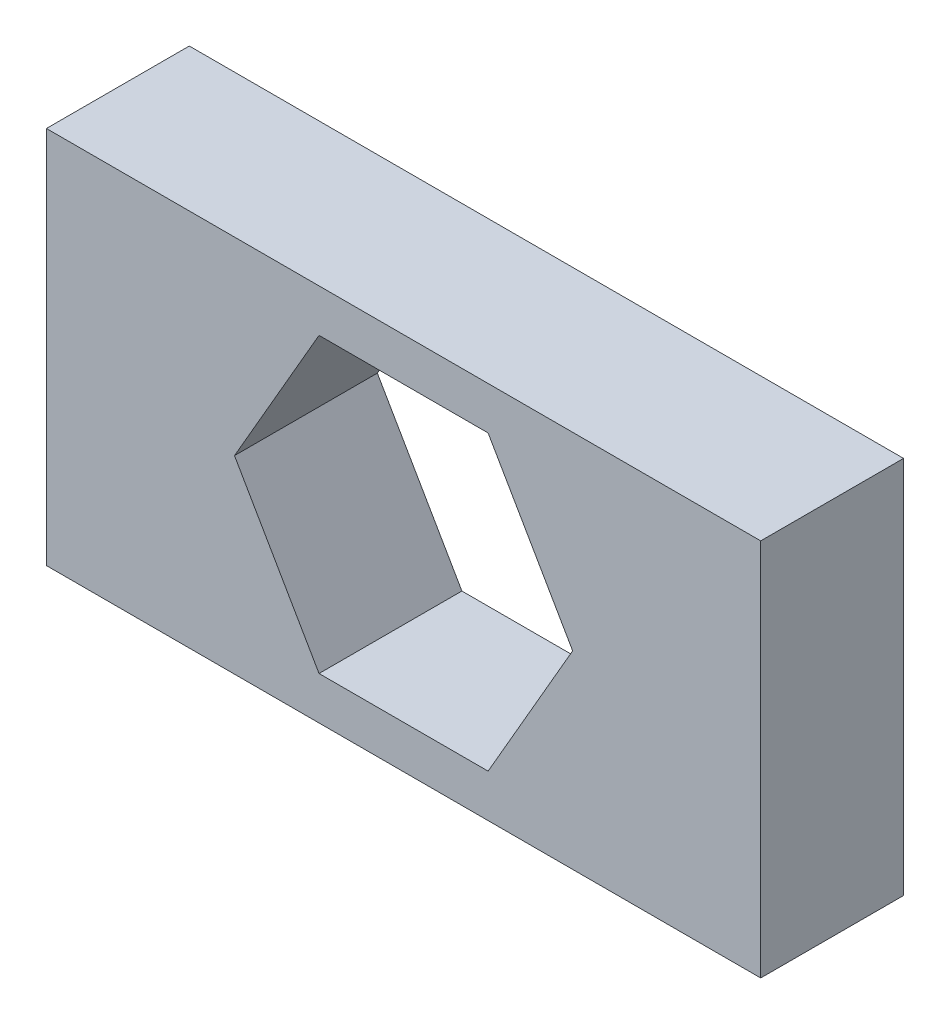
ISO-10303-21;
HEADER;
FILE_DESCRIPTION(('STEP AP214'),'2;1');
FILE_NAME('part.step','',(''),(''),'','','');
FILE_SCHEMA(('AUTOMOTIVE_DESIGN { 1 0 10303 214 1 1 1 1 }'));
ENDSEC;
DATA;
#1=APPLICATION_CONTEXT('core data for automotive mechanical design processes');
#2=APPLICATION_PROTOCOL_DEFINITION('international standard','automotive_design',2000,#1);
#3=PRODUCT_CONTEXT('',#1,'mechanical');
#4=PRODUCT('Part','Part','',(#3));
#5=PRODUCT_RELATED_PRODUCT_CATEGORY('part','',(#4));
#6=PRODUCT_DEFINITION_FORMATION('','',#4);
#7=PRODUCT_DEFINITION_CONTEXT('part definition',#1,'design');
#8=PRODUCT_DEFINITION('design','',#6,#7);
#9=PRODUCT_DEFINITION_SHAPE('','',#8);
#10=(LENGTH_UNIT() NAMED_UNIT(*) SI_UNIT(.MILLI.,.METRE.));
#11=(NAMED_UNIT(*) PLANE_ANGLE_UNIT() SI_UNIT($,.RADIAN.));
#12=(NAMED_UNIT(*) SI_UNIT($,.STERADIAN.) SOLID_ANGLE_UNIT());
#13=UNCERTAINTY_MEASURE_WITH_UNIT(LENGTH_MEASURE(1.E-05),#10,'distance_accuracy_value','');
#14=(GEOMETRIC_REPRESENTATION_CONTEXT(3) GLOBAL_UNCERTAINTY_ASSIGNED_CONTEXT((#13)) GLOBAL_UNIT_ASSIGNED_CONTEXT((#10,
#11,#12)) REPRESENTATION_CONTEXT('',''));
#15=CARTESIAN_POINT('',(0.,0.,0.));
#16=DIRECTION('',(0.,0.,1.));
#17=DIRECTION('',(1.,0.,0.));
#18=AXIS2_PLACEMENT_3D('',#15,#16,#17);
#19=CARTESIAN_POINT('',(0.,0.,2.));
#20=DIRECTION('',(0.,0.,1.));
#21=DIRECTION('',(1.,0.,0.));
#22=AXIS2_PLACEMENT_3D('',#19,#20,#21);
#23=PLANE('',#22);
#24=DIRECTION('',(0.,1.,0.));
#25=VECTOR('',#24,1.);
#26=CARTESIAN_POINT('',(5.,2.65,2.));
#27=LINE('',#26,#25);
#28=CARTESIAN_POINT('',(5.,-2.65,2.));
#29=VERTEX_POINT('',#28);
#30=CARTESIAN_POINT('',(5.,2.65,2.));
#31=VERTEX_POINT('',#30);
#32=EDGE_CURVE('E161',#29,#31,#27,.T.);
#33=ORIENTED_EDGE('',*,*,#32,.T.);
#34=DIRECTION('',(-1.,0.,0.));
#35=VECTOR('',#34,1.);
#36=CARTESIAN_POINT('',(-5.,2.65,2.));
#37=LINE('',#36,#35);
#38=CARTESIAN_POINT('',(-5.,2.65,2.));
#39=VERTEX_POINT('',#38);
#40=EDGE_CURVE('E164',#31,#39,#37,.T.);
#41=ORIENTED_EDGE('',*,*,#40,.T.);
#42=DIRECTION('',(0.,-1.,0.));
#43=VECTOR('',#42,1.);
#44=CARTESIAN_POINT('',(-5.,2.65,2.));
#45=LINE('',#44,#43);
#46=CARTESIAN_POINT('',(-5.,-2.65,2.));
#47=VERTEX_POINT('',#46);
#48=EDGE_CURVE('E167',#39,#47,#45,.T.);
#49=ORIENTED_EDGE('',*,*,#48,.T.);
#50=DIRECTION('',(1.,0.,0.));
#51=VECTOR('',#50,1.);
#52=CARTESIAN_POINT('',(-5.,-2.65,2.));
#53=LINE('',#52,#51);
#54=EDGE_CURVE('E169',#47,#29,#53,.T.);
#55=ORIENTED_EDGE('',*,*,#54,.T.);
#56=EDGE_LOOP('',(#33,#41,#49,#55));
#57=FACE_BOUND('',#56,.T.);
#58=DIRECTION('',(-0.5,0.866025403784438,0.));
#59=VECTOR('',#58,1.);
#60=CARTESIAN_POINT('',(2.36713610367747,0.,2.));
#61=LINE('',#60,#59);
#62=CARTESIAN_POINT('',(2.36713610367747,0.,2.));
#63=VERTEX_POINT('',#62);
#64=CARTESIAN_POINT('',(1.18356805183873,2.05,2.));
#65=VERTEX_POINT('',#64);
#66=EDGE_CURVE('E118',#63,#65,#61,.T.);
#67=ORIENTED_EDGE('',*,*,#66,.F.);
#68=DIRECTION('',(0.5,0.866025403784439,0.));
#69=VECTOR('',#68,1.);
#70=CARTESIAN_POINT('',(1.18356805183873,-2.05,2.));
#71=LINE('',#70,#69);
#72=CARTESIAN_POINT('',(1.18356805183873,-2.05,2.));
#73=VERTEX_POINT('',#72);
#74=EDGE_CURVE('E110',#73,#63,#71,.T.);
#75=ORIENTED_EDGE('',*,*,#74,.F.);
#76=DIRECTION('',(1.,0.,0.));
#77=VECTOR('',#76,1.);
#78=CARTESIAN_POINT('',(-1.18356805183873,-2.05,2.));
#79=LINE('',#78,#77);
#80=CARTESIAN_POINT('',(-1.18356805183873,-2.05,2.));
#81=VERTEX_POINT('',#80);
#82=EDGE_CURVE('E139',#81,#73,#79,.T.);
#83=ORIENTED_EDGE('',*,*,#82,.F.);
#84=DIRECTION('',(0.5,-0.866025403784438,0.));
#85=VECTOR('',#84,1.);
#86=CARTESIAN_POINT('',(-2.36713610367746,0.,2.));
#87=LINE('',#86,#85);
#88=CARTESIAN_POINT('',(-2.36713610367746,0.,2.));
#89=VERTEX_POINT('',#88);
#90=EDGE_CURVE('E137',#89,#81,#87,.T.);
#91=ORIENTED_EDGE('',*,*,#90,.F.);
#92=DIRECTION('',(-0.5,-0.866025403784439,0.));
#93=VECTOR('',#92,1.);
#94=CARTESIAN_POINT('',(-1.18356805183873,2.05,2.));
#95=LINE('',#94,#93);
#96=CARTESIAN_POINT('',(-1.18356805183873,2.05,2.));
#97=VERTEX_POINT('',#96);
#98=EDGE_CURVE('E133',#97,#89,#95,.T.);
#99=ORIENTED_EDGE('',*,*,#98,.F.);
#100=DIRECTION('',(-1.,0.,0.));
#101=VECTOR('',#100,1.);
#102=CARTESIAN_POINT('',(1.18356805183873,2.05,2.));
#103=LINE('',#102,#101);
#104=EDGE_CURVE('E131',#65,#97,#103,.T.);
#105=ORIENTED_EDGE('',*,*,#104,.F.);
#106=EDGE_LOOP('',(#67,#75,#83,#91,#99,#105));
#107=FACE_BOUND('',#106,.T.);
#108=ADVANCED_FACE('F33',(#57,#107),#23,.T.);
#109=CARTESIAN_POINT('',(0.,0.,0.));
#110=DIRECTION('',(0.,0.,1.));
#111=DIRECTION('',(1.,0.,0.));
#112=AXIS2_PLACEMENT_3D('',#109,#110,#111);
#113=PLANE('',#112);
#114=DIRECTION('',(0.,1.,0.));
#115=VECTOR('',#114,1.);
#116=CARTESIAN_POINT('',(5.,2.65,0.));
#117=LINE('',#116,#115);
#118=CARTESIAN_POINT('',(5.,-2.65,0.));
#119=VERTEX_POINT('',#118);
#120=CARTESIAN_POINT('',(5.,2.65,0.));
#121=VERTEX_POINT('',#120);
#122=EDGE_CURVE('E126',#119,#121,#117,.T.);
#123=ORIENTED_EDGE('',*,*,#122,.F.);
#124=DIRECTION('',(1.,0.,0.));
#125=VECTOR('',#124,1.);
#126=CARTESIAN_POINT('',(-5.,-2.65,0.));
#127=LINE('',#126,#125);
#128=CARTESIAN_POINT('',(-5.,-2.65,0.));
#129=VERTEX_POINT('',#128);
#130=EDGE_CURVE('E165',#129,#119,#127,.T.);
#131=ORIENTED_EDGE('',*,*,#130,.F.);
#132=DIRECTION('',(0.,-1.,0.));
#133=VECTOR('',#132,1.);
#134=CARTESIAN_POINT('',(-5.,2.65,0.));
#135=LINE('',#134,#133);
#136=CARTESIAN_POINT('',(-5.,2.65,0.));
#137=VERTEX_POINT('',#136);
#138=EDGE_CURVE('E176',#137,#129,#135,.T.);
#139=ORIENTED_EDGE('',*,*,#138,.F.);
#140=DIRECTION('',(-1.,0.,0.));
#141=VECTOR('',#140,1.);
#142=CARTESIAN_POINT('',(-5.,2.65,0.));
#143=LINE('',#142,#141);
#144=EDGE_CURVE('E174',#121,#137,#143,.T.);
#145=ORIENTED_EDGE('',*,*,#144,.F.);
#146=EDGE_LOOP('',(#123,#131,#139,#145));
#147=FACE_BOUND('',#146,.T.);
#148=DIRECTION('',(0.5,0.866025403784439,0.));
#149=VECTOR('',#148,1.);
#150=CARTESIAN_POINT('',(1.18356805183873,-2.05,0.));
#151=LINE('',#150,#149);
#152=CARTESIAN_POINT('',(1.18356805183873,-2.05,0.));
#153=VERTEX_POINT('',#152);
#154=CARTESIAN_POINT('',(2.36713610367747,0.,0.));
#155=VERTEX_POINT('',#154);
#156=EDGE_CURVE('E56',#153,#155,#151,.T.);
#157=ORIENTED_EDGE('',*,*,#156,.T.);
#158=DIRECTION('',(-0.5,0.866025403784438,0.));
#159=VECTOR('',#158,1.);
#160=CARTESIAN_POINT('',(2.36713610367747,0.,0.));
#161=LINE('',#160,#159);
#162=CARTESIAN_POINT('',(1.18356805183873,2.05,0.));
#163=VERTEX_POINT('',#162);
#164=EDGE_CURVE('E125',#155,#163,#161,.T.);
#165=ORIENTED_EDGE('',*,*,#164,.T.);
#166=DIRECTION('',(-1.,0.,0.));
#167=VECTOR('',#166,1.);
#168=CARTESIAN_POINT('',(1.18356805183873,2.05,0.));
#169=LINE('',#168,#167);
#170=CARTESIAN_POINT('',(-1.18356805183873,2.05,0.));
#171=VERTEX_POINT('',#170);
#172=EDGE_CURVE('E143',#163,#171,#169,.T.);
#173=ORIENTED_EDGE('',*,*,#172,.T.);
#174=DIRECTION('',(-0.5,-0.866025403784439,0.));
#175=VECTOR('',#174,1.);
#176=CARTESIAN_POINT('',(-1.18356805183873,2.05,0.));
#177=LINE('',#176,#175);
#178=CARTESIAN_POINT('',(-2.36713610367746,0.,0.));
#179=VERTEX_POINT('',#178);
#180=EDGE_CURVE('E146',#171,#179,#177,.T.);
#181=ORIENTED_EDGE('',*,*,#180,.T.);
#182=DIRECTION('',(0.5,-0.866025403784438,0.));
#183=VECTOR('',#182,1.);
#184=CARTESIAN_POINT('',(-2.36713610367746,0.,0.));
#185=LINE('',#184,#183);
#186=CARTESIAN_POINT('',(-1.18356805183873,-2.05,0.));
#187=VERTEX_POINT('',#186);
#188=EDGE_CURVE('E149',#179,#187,#185,.T.);
#189=ORIENTED_EDGE('',*,*,#188,.T.);
#190=DIRECTION('',(1.,0.,0.));
#191=VECTOR('',#190,1.);
#192=CARTESIAN_POINT('',(-1.18356805183873,-2.05,0.));
#193=LINE('',#192,#191);
#194=EDGE_CURVE('E119',#187,#153,#193,.T.);
#195=ORIENTED_EDGE('',*,*,#194,.T.);
#196=EDGE_LOOP('',(#157,#165,#173,#181,#189,#195));
#197=FACE_BOUND('',#196,.T.);
#198=ADVANCED_FACE('F194',(#147,#197),#113,.F.);
#199=CARTESIAN_POINT('',(5.,2.65,2.));
#200=DIRECTION('',(-1.,0.,0.));
#201=DIRECTION('',(0.,-1.,0.));
#202=AXIS2_PLACEMENT_3D('',#199,#200,#201);
#203=PLANE('',#202);
#204=ORIENTED_EDGE('',*,*,#122,.T.);
#205=DIRECTION('',(0.,0.,-1.));
#206=VECTOR('',#205,1.);
#207=CARTESIAN_POINT('',(5.,2.65,2.));
#208=LINE('',#207,#206);
#209=EDGE_CURVE('E11',#31,#121,#208,.T.);
#210=ORIENTED_EDGE('',*,*,#209,.F.);
#211=ORIENTED_EDGE('',*,*,#32,.F.);
#212=DIRECTION('',(0.,0.,-1.));
#213=VECTOR('',#212,1.);
#214=CARTESIAN_POINT('',(5.,-2.65,2.));
#215=LINE('',#214,#213);
#216=EDGE_CURVE('E171',#29,#119,#215,.T.);
#217=ORIENTED_EDGE('',*,*,#216,.T.);
#218=EDGE_LOOP('',(#204,#210,#211,#217));
#219=FACE_BOUND('',#218,.T.);
#220=ADVANCED_FACE('F35',(#219),#203,.F.);
#221=CARTESIAN_POINT('',(-5.,2.65,2.));
#222=DIRECTION('',(0.,-1.,0.));
#223=DIRECTION('',(0.,0.,-1.));
#224=AXIS2_PLACEMENT_3D('',#221,#222,#223);
#225=PLANE('',#224);
#226=ORIENTED_EDGE('',*,*,#144,.T.);
#227=DIRECTION('',(0.,0.,-1.));
#228=VECTOR('',#227,1.);
#229=CARTESIAN_POINT('',(-5.,2.65,2.));
#230=LINE('',#229,#228);
#231=EDGE_CURVE('E41',#39,#137,#230,.T.);
#232=ORIENTED_EDGE('',*,*,#231,.F.);
#233=ORIENTED_EDGE('',*,*,#40,.F.);
#234=ORIENTED_EDGE('',*,*,#209,.T.);
#235=EDGE_LOOP('',(#226,#232,#233,#234));
#236=FACE_BOUND('',#235,.T.);
#237=ADVANCED_FACE('F204',(#236),#225,.F.);
#238=CARTESIAN_POINT('',(-5.,2.65,2.));
#239=DIRECTION('',(1.,0.,0.));
#240=DIRECTION('',(0.,0.,-1.));
#241=AXIS2_PLACEMENT_3D('',#238,#239,#240);
#242=PLANE('',#241);
#243=ORIENTED_EDGE('',*,*,#138,.T.);
#244=DIRECTION('',(0.,0.,-1.));
#245=VECTOR('',#244,1.);
#246=CARTESIAN_POINT('',(-5.,-2.65,2.));
#247=LINE('',#246,#245);
#248=EDGE_CURVE('E181',#47,#129,#247,.T.);
#249=ORIENTED_EDGE('',*,*,#248,.F.);
#250=ORIENTED_EDGE('',*,*,#48,.F.);
#251=ORIENTED_EDGE('',*,*,#231,.T.);
#252=EDGE_LOOP('',(#243,#249,#250,#251));
#253=FACE_BOUND('',#252,.T.);
#254=ADVANCED_FACE('F188',(#253),#242,.F.);
#255=CARTESIAN_POINT('',(-5.,-2.65,2.));
#256=DIRECTION('',(0.,1.,0.));
#257=DIRECTION('',(-1.,0.,0.));
#258=AXIS2_PLACEMENT_3D('',#255,#256,#257);
#259=PLANE('',#258);
#260=ORIENTED_EDGE('',*,*,#130,.T.);
#261=ORIENTED_EDGE('',*,*,#216,.F.);
#262=ORIENTED_EDGE('',*,*,#54,.F.);
#263=ORIENTED_EDGE('',*,*,#248,.T.);
#264=EDGE_LOOP('',(#260,#261,#262,#263));
#265=FACE_BOUND('',#264,.T.);
#266=ADVANCED_FACE('F198',(#265),#259,.F.);
#267=CARTESIAN_POINT('',(1.18356805183873,-2.05,2.));
#268=DIRECTION('',(-0.866025403784439,0.5,0.));
#269=DIRECTION('',(-0.5,-0.866025403784439,0.));
#270=AXIS2_PLACEMENT_3D('',#267,#268,#269);
#271=PLANE('',#270);
#272=ORIENTED_EDGE('',*,*,#156,.F.);
#273=DIRECTION('',(0.,0.,-1.));
#274=VECTOR('',#273,1.);
#275=CARTESIAN_POINT('',(1.18356805183873,-2.05,2.));
#276=LINE('',#275,#274);
#277=EDGE_CURVE('E114',#73,#153,#276,.T.);
#278=ORIENTED_EDGE('',*,*,#277,.F.);
#279=ORIENTED_EDGE('',*,*,#74,.T.);
#280=DIRECTION('',(0.,0.,-1.));
#281=VECTOR('',#280,1.);
#282=CARTESIAN_POINT('',(2.36713610367747,0.,2.));
#283=LINE('',#282,#281);
#284=EDGE_CURVE('E113',#63,#155,#283,.T.);
#285=ORIENTED_EDGE('',*,*,#284,.T.);
#286=EDGE_LOOP('',(#272,#278,#279,#285));
#287=FACE_BOUND('',#286,.T.);
#288=ADVANCED_FACE('F112',(#287),#271,.T.);
#289=CARTESIAN_POINT('',(2.36713610367747,0.,2.));
#290=DIRECTION('',(-0.866025403784439,-0.5,0.));
#291=DIRECTION('',(0.5,-0.866025403784438,0.));
#292=AXIS2_PLACEMENT_3D('',#289,#290,#291);
#293=PLANE('',#292);
#294=ORIENTED_EDGE('',*,*,#164,.F.);
#295=ORIENTED_EDGE('',*,*,#284,.F.);
#296=ORIENTED_EDGE('',*,*,#66,.T.);
#297=DIRECTION('',(0.,0.,-1.));
#298=VECTOR('',#297,1.);
#299=CARTESIAN_POINT('',(1.18356805183873,2.05,2.));
#300=LINE('',#299,#298);
#301=EDGE_CURVE('E127',#65,#163,#300,.T.);
#302=ORIENTED_EDGE('',*,*,#301,.T.);
#303=EDGE_LOOP('',(#294,#295,#296,#302));
#304=FACE_BOUND('',#303,.T.);
#305=ADVANCED_FACE('F122',(#304),#293,.T.);
#306=CARTESIAN_POINT('',(1.18356805183873,2.05,2.));
#307=DIRECTION('',(0.,-1.,0.));
#308=DIRECTION('',(1.,0.,0.));
#309=AXIS2_PLACEMENT_3D('',#306,#307,#308);
#310=PLANE('',#309);
#311=ORIENTED_EDGE('',*,*,#172,.F.);
#312=ORIENTED_EDGE('',*,*,#301,.F.);
#313=ORIENTED_EDGE('',*,*,#104,.T.);
#314=DIRECTION('',(0.,0.,-1.));
#315=VECTOR('',#314,1.);
#316=CARTESIAN_POINT('',(-1.18356805183873,2.05,2.));
#317=LINE('',#316,#315);
#318=EDGE_CURVE('E158',#97,#171,#317,.T.);
#319=ORIENTED_EDGE('',*,*,#318,.T.);
#320=EDGE_LOOP('',(#311,#312,#313,#319));
#321=FACE_BOUND('',#320,.T.);
#322=ADVANCED_FACE('F227',(#321),#310,.T.);
#323=CARTESIAN_POINT('',(-1.18356805183873,2.05,2.));
#324=DIRECTION('',(0.866025403784439,-0.5,0.));
#325=DIRECTION('',(0.5,0.866025403784439,0.));
#326=AXIS2_PLACEMENT_3D('',#323,#324,#325);
#327=PLANE('',#326);
#328=ORIENTED_EDGE('',*,*,#180,.F.);
#329=ORIENTED_EDGE('',*,*,#318,.F.);
#330=ORIENTED_EDGE('',*,*,#98,.T.);
#331=DIRECTION('',(0.,0.,-1.));
#332=VECTOR('',#331,1.);
#333=CARTESIAN_POINT('',(-2.36713610367746,0.,2.));
#334=LINE('',#333,#332);
#335=EDGE_CURVE('E156',#89,#179,#334,.T.);
#336=ORIENTED_EDGE('',*,*,#335,.T.);
#337=EDGE_LOOP('',(#328,#329,#330,#336));
#338=FACE_BOUND('',#337,.T.);
#339=ADVANCED_FACE('F231',(#338),#327,.T.);
#340=CARTESIAN_POINT('',(-2.36713610367746,0.,2.));
#341=DIRECTION('',(0.866025403784438,0.5,0.));
#342=DIRECTION('',(-0.5,0.866025403784439,0.));
#343=AXIS2_PLACEMENT_3D('',#340,#341,#342);
#344=PLANE('',#343);
#345=ORIENTED_EDGE('',*,*,#188,.F.);
#346=ORIENTED_EDGE('',*,*,#335,.F.);
#347=ORIENTED_EDGE('',*,*,#90,.T.);
#348=DIRECTION('',(0.,0.,-1.));
#349=VECTOR('',#348,1.);
#350=CARTESIAN_POINT('',(-1.18356805183873,-2.05,2.));
#351=LINE('',#350,#349);
#352=EDGE_CURVE('E48',#81,#187,#351,.T.);
#353=ORIENTED_EDGE('',*,*,#352,.T.);
#354=EDGE_LOOP('',(#345,#346,#347,#353));
#355=FACE_BOUND('',#354,.T.);
#356=ADVANCED_FACE('F237',(#355),#344,.T.);
#357=CARTESIAN_POINT('',(-1.18356805183873,-2.05,2.));
#358=DIRECTION('',(0.,1.,0.));
#359=DIRECTION('',(-1.,0.,0.));
#360=AXIS2_PLACEMENT_3D('',#357,#358,#359);
#361=PLANE('',#360);
#362=ORIENTED_EDGE('',*,*,#194,.F.);
#363=ORIENTED_EDGE('',*,*,#352,.F.);
#364=ORIENTED_EDGE('',*,*,#82,.T.);
#365=ORIENTED_EDGE('',*,*,#277,.T.);
#366=EDGE_LOOP('',(#362,#363,#364,#365));
#367=FACE_BOUND('',#366,.T.);
#368=ADVANCED_FACE('F241',(#367),#361,.T.);
#369=CLOSED_SHELL('',(#108,#198,#220,#237,#254,#266,#288,#305,#322,#339,#356,#368));
#370=MANIFOLD_SOLID_BREP('B2',#369);
#371=ADVANCED_BREP_SHAPE_REPRESENTATION('',(#18,#370),#14);
#372=SHAPE_DEFINITION_REPRESENTATION(#9,#371);
ENDSEC;
END-ISO-10303-21;
